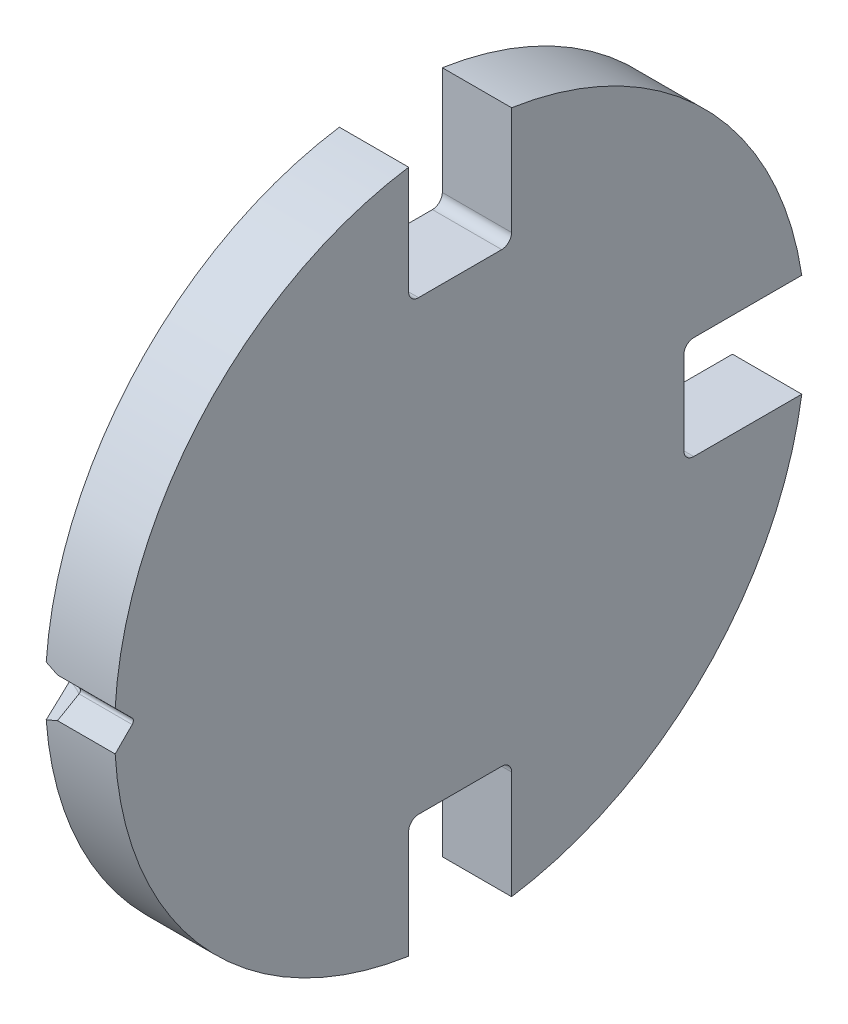
ISO-10303-21;
HEADER;
FILE_DESCRIPTION(('STEP AP214'),'2;1');
FILE_NAME('part.step','',(''),(''),'','','');
FILE_SCHEMA(('AUTOMOTIVE_DESIGN { 1 0 10303 214 1 1 1 1 }'));
ENDSEC;
DATA;
#1=APPLICATION_CONTEXT('core data for automotive mechanical design processes');
#2=APPLICATION_PROTOCOL_DEFINITION('international standard','automotive_design',2000,#1);
#3=PRODUCT_CONTEXT('',#1,'mechanical');
#4=PRODUCT('Part','Part','',(#3));
#5=PRODUCT_RELATED_PRODUCT_CATEGORY('part','',(#4));
#6=PRODUCT_DEFINITION_FORMATION('','',#4);
#7=PRODUCT_DEFINITION_CONTEXT('part definition',#1,'design');
#8=PRODUCT_DEFINITION('design','',#6,#7);
#9=PRODUCT_DEFINITION_SHAPE('','',#8);
#10=(LENGTH_UNIT() NAMED_UNIT(*) SI_UNIT(.MILLI.,.METRE.));
#11=(NAMED_UNIT(*) PLANE_ANGLE_UNIT() SI_UNIT($,.RADIAN.));
#12=(NAMED_UNIT(*) SI_UNIT($,.STERADIAN.) SOLID_ANGLE_UNIT());
#13=UNCERTAINTY_MEASURE_WITH_UNIT(LENGTH_MEASURE(1.E-05),#10,'distance_accuracy_value','');
#14=(GEOMETRIC_REPRESENTATION_CONTEXT(3) GLOBAL_UNCERTAINTY_ASSIGNED_CONTEXT((#13)) GLOBAL_UNIT_ASSIGNED_CONTEXT((#10,
#11,#12)) REPRESENTATION_CONTEXT('',''));
#15=CARTESIAN_POINT('',(0.,0.,0.));
#16=DIRECTION('',(0.,0.,1.));
#17=DIRECTION('',(1.,0.,0.));
#18=AXIS2_PLACEMENT_3D('',#15,#16,#17);
#19=CARTESIAN_POINT('',(156.05,0.,8.725));
#20=DIRECTION('',(1.,0.,0.));
#21=DIRECTION('',(0.,1.,0.));
#22=AXIS2_PLACEMENT_3D('',#19,#20,#21);
#23=PLANE('',#22);
#24=DIRECTION('',(0.,-0.707106781186548,0.707106781186547));
#25=VECTOR('',#24,1.);
#26=CARTESIAN_POINT('',(156.05,1.67408078537024,14.7472423561298));
#27=LINE('',#26,#25);
#28=CARTESIAN_POINT('',(156.05,-0.14142135623731,16.5627444977373));
#29=VERTEX_POINT('',#28);
#30=CARTESIAN_POINT('',(156.05,-1.00000000001903,17.421323141519));
#31=VERTEX_POINT('',#30);
#32=EDGE_CURVE('E404',#29,#31,#27,.T.);
#33=ORIENTED_EDGE('',*,*,#32,.T.);
#34=CARTESIAN_POINT('',(156.05,0.,0.));
#35=DIRECTION('',(1.,0.,0.));
#36=DIRECTION('',(0.,0.,1.));
#37=AXIS2_PLACEMENT_3D('',#34,#35,#36);
#38=CIRCLE('',#37,17.45);
#39=CARTESIAN_POINT('',(156.05,-17.2552166025234,2.6));
#40=VERTEX_POINT('',#39);
#41=EDGE_CURVE('E410',#31,#40,#38,.T.);
#42=ORIENTED_EDGE('',*,*,#41,.T.);
#43=DIRECTION('',(0.,1.,0.));
#44=VECTOR('',#43,1.);
#45=CARTESIAN_POINT('',(156.05,-8.4,2.6));
#46=LINE('',#45,#44);
#47=CARTESIAN_POINT('',(156.05,-11.8,2.6));
#48=VERTEX_POINT('',#47);
#49=EDGE_CURVE('E541',#40,#48,#46,.T.);
#50=ORIENTED_EDGE('',*,*,#49,.T.);
#51=CARTESIAN_POINT('',(156.05,-11.8000000001,2.0999999999));
#52=DIRECTION('',(-1.,0.,0.));
#53=DIRECTION('',(0.,1.,2.00716776532771E-10));
#54=AXIS2_PLACEMENT_3D('',#51,#52,#53);
#55=CIRCLE('',#54,0.5);
#56=CARTESIAN_POINT('',(156.05,-11.3000000001,2.10000000000036));
#57=VERTEX_POINT('',#56);
#58=EDGE_CURVE('E544',#48,#57,#55,.T.);
#59=ORIENTED_EDGE('',*,*,#58,.T.);
#60=DIRECTION('',(0.,0.,-1.));
#61=VECTOR('',#60,1.);
#62=CARTESIAN_POINT('',(156.05,-11.3,3.8375));
#63=LINE('',#62,#61);
#64=CARTESIAN_POINT('',(156.05,-11.3,-2.1));
#65=VERTEX_POINT('',#64);
#66=EDGE_CURVE('E615',#57,#65,#63,.T.);
#67=ORIENTED_EDGE('',*,*,#66,.T.);
#68=CARTESIAN_POINT('',(156.05,-11.8000000001,-2.0999999999));
#69=DIRECTION('',(-1.,0.,0.));
#70=DIRECTION('',(0.,2.00714111997513E-10,-1.));
#71=AXIS2_PLACEMENT_3D('',#68,#69,#70);
#72=CIRCLE('',#71,0.5);
#73=CARTESIAN_POINT('',(156.05,-11.7999999999996,-2.5999999999));
#74=VERTEX_POINT('',#73);
#75=EDGE_CURVE('E519',#65,#74,#72,.T.);
#76=ORIENTED_EDGE('',*,*,#75,.T.);
#77=DIRECTION('',(0.,-1.,0.));
#78=VECTOR('',#77,1.);
#79=CARTESIAN_POINT('',(156.05,-8.39999999999991,-2.6));
#80=LINE('',#79,#78);
#81=CARTESIAN_POINT('',(156.05,-17.2552166025234,-2.6));
#82=VERTEX_POINT('',#81);
#83=EDGE_CURVE('E566',#74,#82,#80,.T.);
#84=ORIENTED_EDGE('',*,*,#83,.T.);
#85=CARTESIAN_POINT('',(156.05,0.,0.));
#86=DIRECTION('',(1.,0.,0.));
#87=DIRECTION('',(0.,0.,1.));
#88=AXIS2_PLACEMENT_3D('',#85,#86,#87);
#89=CIRCLE('',#88,17.45);
#90=CARTESIAN_POINT('',(156.05,-2.6,-17.2552166025234));
#91=VERTEX_POINT('',#90);
#92=EDGE_CURVE('E552',#82,#91,#89,.T.);
#93=ORIENTED_EDGE('',*,*,#92,.T.);
#94=DIRECTION('',(0.,0.,1.));
#95=VECTOR('',#94,1.);
#96=CARTESIAN_POINT('',(156.05,-2.6,-4.0375));
#97=LINE('',#96,#95);
#98=CARTESIAN_POINT('',(156.05,-2.6,-11.8));
#99=VERTEX_POINT('',#98);
#100=EDGE_CURVE('E602',#91,#99,#97,.T.);
#101=ORIENTED_EDGE('',*,*,#100,.T.);
#102=CARTESIAN_POINT('',(156.05,-2.0999999999,-11.8000000001));
#103=DIRECTION('',(-1.,0.,0.));
#104=DIRECTION('',(0.,-2.00716776532771E-10,1.));
#105=AXIS2_PLACEMENT_3D('',#102,#103,#104);
#106=CIRCLE('',#105,0.5);
#107=CARTESIAN_POINT('',(156.05,-2.10000000000036,-11.3000000001));
#108=VERTEX_POINT('',#107);
#109=EDGE_CURVE('E597',#99,#108,#106,.T.);
#110=ORIENTED_EDGE('',*,*,#109,.T.);
#111=DIRECTION('',(0.,1.,0.));
#112=VECTOR('',#111,1.);
#113=CARTESIAN_POINT('',(156.05,0.525,-11.3));
#114=LINE('',#113,#112);
#115=CARTESIAN_POINT('',(156.05,2.1,-11.3));
#116=VERTEX_POINT('',#115);
#117=EDGE_CURVE('E556',#108,#116,#114,.T.);
#118=ORIENTED_EDGE('',*,*,#117,.T.);
#119=CARTESIAN_POINT('',(156.05,2.0999999999,-11.8000000001));
#120=DIRECTION('',(-1.,0.,0.));
#121=DIRECTION('',(0.,1.,2.00714111997513E-10));
#122=AXIS2_PLACEMENT_3D('',#119,#120,#121);
#123=CIRCLE('',#122,0.5);
#124=CARTESIAN_POINT('',(156.05,2.5999999999,-11.7999999999996));
#125=VERTEX_POINT('',#124);
#126=EDGE_CURVE('E952',#116,#125,#123,.T.);
#127=ORIENTED_EDGE('',*,*,#126,.T.);
#128=DIRECTION('',(0.,0.,-1.));
#129=VECTOR('',#128,1.);
#130=CARTESIAN_POINT('',(156.05,2.6,-4.03749999999991));
#131=LINE('',#130,#129);
#132=CARTESIAN_POINT('',(156.05,2.6,-17.2552166025234));
#133=VERTEX_POINT('',#132);
#134=EDGE_CURVE('E953',#125,#133,#131,.T.);
#135=ORIENTED_EDGE('',*,*,#134,.T.);
#136=CARTESIAN_POINT('',(156.05,0.,0.));
#137=DIRECTION('',(1.,0.,0.));
#138=DIRECTION('',(0.,0.,1.));
#139=AXIS2_PLACEMENT_3D('',#136,#137,#138);
#140=CIRCLE('',#139,17.45);
#141=CARTESIAN_POINT('',(156.05,17.2552166025234,-2.6));
#142=VERTEX_POINT('',#141);
#143=EDGE_CURVE('E606',#133,#142,#140,.T.);
#144=ORIENTED_EDGE('',*,*,#143,.T.);
#145=DIRECTION('',(0.,-1.,0.));
#146=VECTOR('',#145,1.);
#147=CARTESIAN_POINT('',(156.05,8.4,-2.6));
#148=LINE('',#147,#146);
#149=CARTESIAN_POINT('',(156.05,11.8,-2.6));
#150=VERTEX_POINT('',#149);
#151=EDGE_CURVE('E596',#142,#150,#148,.T.);
#152=ORIENTED_EDGE('',*,*,#151,.T.);
#153=CARTESIAN_POINT('',(156.05,11.8000000001,-2.0999999999));
#154=DIRECTION('',(-1.,0.,0.));
#155=DIRECTION('',(0.,-1.,-2.00716776532771E-10));
#156=AXIS2_PLACEMENT_3D('',#153,#154,#155);
#157=CIRCLE('',#156,0.5);
#158=CARTESIAN_POINT('',(156.05,11.3000000001,-2.10000000000036));
#159=VERTEX_POINT('',#158);
#160=EDGE_CURVE('E965',#150,#159,#157,.T.);
#161=ORIENTED_EDGE('',*,*,#160,.T.);
#162=DIRECTION('',(0.,0.,1.));
#163=VECTOR('',#162,1.);
#164=CARTESIAN_POINT('',(156.05,11.3,4.8875));
#165=LINE('',#164,#163);
#166=CARTESIAN_POINT('',(156.05,11.3,2.1));
#167=VERTEX_POINT('',#166);
#168=EDGE_CURVE('E11',#159,#167,#165,.T.);
#169=ORIENTED_EDGE('',*,*,#168,.T.);
#170=CARTESIAN_POINT('',(156.05,11.8000000001,2.0999999999));
#171=DIRECTION('',(-1.,0.,0.));
#172=DIRECTION('',(0.,-2.00714111997513E-10,1.));
#173=AXIS2_PLACEMENT_3D('',#170,#171,#172);
#174=CIRCLE('',#173,0.5);
#175=CARTESIAN_POINT('',(156.05,11.7999999999996,2.5999999999));
#176=VERTEX_POINT('',#175);
#177=EDGE_CURVE('E943',#167,#176,#174,.T.);
#178=ORIENTED_EDGE('',*,*,#177,.T.);
#179=DIRECTION('',(0.,1.,0.));
#180=VECTOR('',#179,1.);
#181=CARTESIAN_POINT('',(156.05,8.39999999999991,2.6));
#182=LINE('',#181,#180);
#183=CARTESIAN_POINT('',(156.05,17.2552166025234,2.6));
#184=VERTEX_POINT('',#183);
#185=EDGE_CURVE('E576',#176,#184,#182,.T.);
#186=ORIENTED_EDGE('',*,*,#185,.T.);
#187=CARTESIAN_POINT('',(156.05,0.,0.));
#188=DIRECTION('',(1.,0.,0.));
#189=DIRECTION('',(0.,0.,1.));
#190=AXIS2_PLACEMENT_3D('',#187,#188,#189);
#191=CIRCLE('',#190,17.45);
#192=CARTESIAN_POINT('',(156.05,1.00000000001902,17.421323141519));
#193=VERTEX_POINT('',#192);
#194=EDGE_CURVE('E397',#184,#193,#191,.T.);
#195=ORIENTED_EDGE('',*,*,#194,.T.);
#196=DIRECTION('',(0.,-0.707106781186547,-0.707106781186548));
#197=VECTOR('',#196,1.);
#198=CARTESIAN_POINT('',(156.05,-1.67408078537024,14.7472423561298));
#199=LINE('',#198,#197);
#200=CARTESIAN_POINT('',(156.05,0.141421356166717,16.5627444978081));
#201=VERTEX_POINT('',#200);
#202=EDGE_CURVE('E452',#193,#201,#199,.T.);
#203=ORIENTED_EDGE('',*,*,#202,.T.);
#204=CARTESIAN_POINT('',(156.05,0.,16.704165854116));
#205=DIRECTION('',(-1.,0.,0.));
#206=DIRECTION('',(0.,-0.707106780833585,-0.70710678153951));
#207=AXIS2_PLACEMENT_3D('',#204,#205,#206);
#208=CIRCLE('',#207,0.2);
#209=EDGE_CURVE('E418',#201,#29,#208,.T.);
#210=ORIENTED_EDGE('',*,*,#209,.T.);
#211=EDGE_LOOP('',(#33,#42,#50,#59,#67,#76,#84,#93,#101,#110,#118,#127,#135,#144,#152,#161,#169,
#178,#186,#195,#203,#210));
#212=FACE_BOUND('',#211,.T.);
#213=ADVANCED_FACE('F17',(#212),#23,.T.);
#214=CARTESIAN_POINT('',(152.55,11.3,1.05));
#215=DIRECTION('',(0.,-1.,0.));
#216=DIRECTION('',(0.,0.,-1.));
#217=AXIS2_PLACEMENT_3D('',#214,#215,#216);
#218=PLANE('',#217);
#219=ORIENTED_EDGE('',*,*,#168,.F.);
#220=DIRECTION('',(1.,0.,0.));
#221=VECTOR('',#220,1.);
#222=CARTESIAN_POINT('',(152.55,11.3000000001,-2.10000000000036));
#223=LINE('',#222,#221);
#224=CARTESIAN_POINT('',(152.55,11.3000000001,-2.10000000000036));
#225=VERTEX_POINT('',#224);
#226=EDGE_CURVE('E28',#225,#159,#223,.T.);
#227=ORIENTED_EDGE('',*,*,#226,.F.);
#228=DIRECTION('',(0.,0.,-1.));
#229=VECTOR('',#228,1.);
#230=CARTESIAN_POINT('',(152.55,11.3,4.8875));
#231=LINE('',#230,#229);
#232=CARTESIAN_POINT('',(152.55,11.3,2.1));
#233=VERTEX_POINT('',#232);
#234=EDGE_CURVE('E550',#233,#225,#231,.T.);
#235=ORIENTED_EDGE('',*,*,#234,.F.);
#236=DIRECTION('',(1.,0.,0.));
#237=VECTOR('',#236,1.);
#238=CARTESIAN_POINT('',(152.55,11.3,2.1));
#239=LINE('',#238,#237);
#240=EDGE_CURVE('E577',#233,#167,#239,.T.);
#241=ORIENTED_EDGE('',*,*,#240,.T.);
#242=EDGE_LOOP('',(#219,#227,#235,#241));
#243=FACE_BOUND('',#242,.T.);
#244=ADVANCED_FACE('F501',(#243),#218,.F.);
#245=CARTESIAN_POINT('',(152.55,11.8000000001,-2.0999999999));
#246=DIRECTION('',(1.,0.,0.));
#247=DIRECTION('',(0.,-1.,-2.00716776532771E-10));
#248=AXIS2_PLACEMENT_3D('',#245,#246,#247);
#249=CYLINDRICAL_SURFACE('',#248,0.5);
#250=ORIENTED_EDGE('',*,*,#160,.F.);
#251=DIRECTION('',(1.,0.,0.));
#252=VECTOR('',#251,1.);
#253=CARTESIAN_POINT('',(152.55,11.8,-2.6));
#254=LINE('',#253,#252);
#255=CARTESIAN_POINT('',(152.55,11.8,-2.6));
#256=VERTEX_POINT('',#255);
#257=EDGE_CURVE('E592',#256,#150,#254,.T.);
#258=ORIENTED_EDGE('',*,*,#257,.F.);
#259=CARTESIAN_POINT('',(152.55,11.8000000001,-2.0999999999));
#260=DIRECTION('',(1.,0.,0.));
#261=DIRECTION('',(0.,-1.,-2.00716776532771E-10));
#262=AXIS2_PLACEMENT_3D('',#259,#260,#261);
#263=CIRCLE('',#262,0.5);
#264=EDGE_CURVE('E954',#225,#256,#263,.T.);
#265=ORIENTED_EDGE('',*,*,#264,.F.);
#266=ORIENTED_EDGE('',*,*,#226,.T.);
#267=EDGE_LOOP('',(#250,#258,#265,#266));
#268=FACE_BOUND('',#267,.T.);
#269=ADVANCED_FACE('F505',(#268),#249,.F.);
#270=CARTESIAN_POINT('',(152.55,16.8,-2.6));
#271=DIRECTION('',(0.,0.,-1.));
#272=DIRECTION('',(0.,-1.,0.));
#273=AXIS2_PLACEMENT_3D('',#270,#271,#272);
#274=PLANE('',#273);
#275=DIRECTION('',(1.,0.,0.));
#276=VECTOR('',#275,1.);
#277=CARTESIAN_POINT('',(154.3,17.2552166025234,-2.6));
#278=LINE('',#277,#276);
#279=CARTESIAN_POINT('',(152.55,17.2552166025234,-2.6));
#280=VERTEX_POINT('',#279);
#281=EDGE_CURVE('E555',#280,#142,#278,.T.);
#282=ORIENTED_EDGE('',*,*,#281,.F.);
#283=DIRECTION('',(0.,1.,0.));
#284=VECTOR('',#283,1.);
#285=CARTESIAN_POINT('',(152.55,8.4,-2.6));
#286=LINE('',#285,#284);
#287=EDGE_CURVE('E958',#256,#280,#286,.T.);
#288=ORIENTED_EDGE('',*,*,#287,.F.);
#289=ORIENTED_EDGE('',*,*,#257,.T.);
#290=ORIENTED_EDGE('',*,*,#151,.F.);
#291=EDGE_LOOP('',(#282,#288,#289,#290));
#292=FACE_BOUND('',#291,.T.);
#293=ADVANCED_FACE('F19',(#292),#274,.F.);
#294=CARTESIAN_POINT('',(152.55,16.8,2.6));
#295=DIRECTION('',(0.,0.,1.));
#296=DIRECTION('',(1.,0.,0.));
#297=AXIS2_PLACEMENT_3D('',#294,#295,#296);
#298=PLANE('',#297);
#299=DIRECTION('',(-1.,0.,0.));
#300=VECTOR('',#299,1.);
#301=CARTESIAN_POINT('',(154.3,17.2552166025234,2.6));
#302=LINE('',#301,#300);
#303=CARTESIAN_POINT('',(152.55,17.2552166025234,2.6));
#304=VERTEX_POINT('',#303);
#305=EDGE_CURVE('E530',#184,#304,#302,.T.);
#306=ORIENTED_EDGE('',*,*,#305,.F.);
#307=ORIENTED_EDGE('',*,*,#185,.F.);
#308=DIRECTION('',(1.,0.,0.));
#309=VECTOR('',#308,1.);
#310=CARTESIAN_POINT('',(152.55,11.7999999999996,2.5999999999));
#311=LINE('',#310,#309);
#312=CARTESIAN_POINT('',(152.55,11.7999999999996,2.5999999999));
#313=VERTEX_POINT('',#312);
#314=EDGE_CURVE('E573',#313,#176,#311,.T.);
#315=ORIENTED_EDGE('',*,*,#314,.F.);
#316=DIRECTION('',(0.,-1.,0.));
#317=VECTOR('',#316,1.);
#318=CARTESIAN_POINT('',(152.55,8.39999999999991,2.6));
#319=LINE('',#318,#317);
#320=EDGE_CURVE('E551',#304,#313,#319,.T.);
#321=ORIENTED_EDGE('',*,*,#320,.F.);
#322=EDGE_LOOP('',(#306,#307,#315,#321));
#323=FACE_BOUND('',#322,.T.);
#324=ADVANCED_FACE('F498',(#323),#298,.F.);
#325=CARTESIAN_POINT('',(152.55,11.8000000001,2.0999999999));
#326=DIRECTION('',(1.,0.,0.));
#327=DIRECTION('',(0.,-2.00714111997513E-10,1.));
#328=AXIS2_PLACEMENT_3D('',#325,#326,#327);
#329=CYLINDRICAL_SURFACE('',#328,0.5);
#330=ORIENTED_EDGE('',*,*,#177,.F.);
#331=ORIENTED_EDGE('',*,*,#240,.F.);
#332=CARTESIAN_POINT('',(152.55,11.8000000001,2.0999999999));
#333=DIRECTION('',(1.,0.,0.));
#334=DIRECTION('',(0.,-2.00714111997513E-10,1.));
#335=AXIS2_PLACEMENT_3D('',#332,#333,#334);
#336=CIRCLE('',#335,0.5);
#337=EDGE_CURVE('E546',#313,#233,#336,.T.);
#338=ORIENTED_EDGE('',*,*,#337,.F.);
#339=ORIENTED_EDGE('',*,*,#314,.T.);
#340=EDGE_LOOP('',(#330,#331,#338,#339));
#341=FACE_BOUND('',#340,.T.);
#342=ADVANCED_FACE('F334',(#341),#329,.F.);
#343=CARTESIAN_POINT('',(154.3,0.,0.));
#344=DIRECTION('',(1.,0.,0.));
#345=DIRECTION('',(0.,0.,1.));
#346=AXIS2_PLACEMENT_3D('',#343,#344,#345);
#347=CYLINDRICAL_SURFACE('',#346,17.45);
#348=DIRECTION('',(-1.,0.,0.));
#349=VECTOR('',#348,1.);
#350=CARTESIAN_POINT('',(154.3,2.6,-17.2552166025234));
#351=LINE('',#350,#349);
#352=CARTESIAN_POINT('',(152.55,2.6,-17.2552166025234));
#353=VERTEX_POINT('',#352);
#354=EDGE_CURVE('E978',#133,#353,#351,.T.);
#355=ORIENTED_EDGE('',*,*,#354,.T.);
#356=CARTESIAN_POINT('',(152.55,0.,0.));
#357=DIRECTION('',(1.,0.,0.));
#358=DIRECTION('',(0.,0.,1.));
#359=AXIS2_PLACEMENT_3D('',#356,#357,#358);
#360=CIRCLE('',#359,17.45);
#361=EDGE_CURVE('E562',#353,#280,#360,.T.);
#362=ORIENTED_EDGE('',*,*,#361,.T.);
#363=ORIENTED_EDGE('',*,*,#281,.T.);
#364=ORIENTED_EDGE('',*,*,#143,.F.);
#365=EDGE_LOOP('',(#355,#362,#363,#364));
#366=FACE_BOUND('',#365,.T.);
#367=ADVANCED_FACE('F488',(#366),#347,.T.);
#368=CARTESIAN_POINT('',(154.3,0.,0.));
#369=DIRECTION('',(1.,0.,0.));
#370=DIRECTION('',(0.,0.,1.));
#371=AXIS2_PLACEMENT_3D('',#368,#369,#370);
#372=CYLINDRICAL_SURFACE('',#371,17.45);
#373=DIRECTION('',(-1.,0.,0.));
#374=VECTOR('',#373,1.);
#375=CARTESIAN_POINT('',(154.3,-17.2552166025234,-2.6));
#376=LINE('',#375,#374);
#377=CARTESIAN_POINT('',(152.55,-17.2552166025234,-2.6));
#378=VERTEX_POINT('',#377);
#379=EDGE_CURVE('E563',#82,#378,#376,.T.);
#380=ORIENTED_EDGE('',*,*,#379,.T.);
#381=CARTESIAN_POINT('',(152.55,0.,0.));
#382=DIRECTION('',(1.,0.,0.));
#383=DIRECTION('',(0.,0.,1.));
#384=AXIS2_PLACEMENT_3D('',#381,#382,#383);
#385=CIRCLE('',#384,17.45);
#386=CARTESIAN_POINT('',(152.55,-2.6,-17.2552166025234));
#387=VERTEX_POINT('',#386);
#388=EDGE_CURVE('E587',#378,#387,#385,.T.);
#389=ORIENTED_EDGE('',*,*,#388,.T.);
#390=DIRECTION('',(1.,0.,0.));
#391=VECTOR('',#390,1.);
#392=CARTESIAN_POINT('',(154.3,-2.6,-17.2552166025234));
#393=LINE('',#392,#391);
#394=EDGE_CURVE('E611',#387,#91,#393,.T.);
#395=ORIENTED_EDGE('',*,*,#394,.T.);
#396=ORIENTED_EDGE('',*,*,#92,.F.);
#397=EDGE_LOOP('',(#380,#389,#395,#396));
#398=FACE_BOUND('',#397,.T.);
#399=ADVANCED_FACE('F303',(#398),#372,.T.);
#400=CARTESIAN_POINT('',(152.55,1.05,-11.3));
#401=DIRECTION('',(0.,0.,1.));
#402=DIRECTION('',(1.,0.,0.));
#403=AXIS2_PLACEMENT_3D('',#400,#401,#402);
#404=PLANE('',#403);
#405=ORIENTED_EDGE('',*,*,#117,.F.);
#406=DIRECTION('',(1.,0.,0.));
#407=VECTOR('',#406,1.);
#408=CARTESIAN_POINT('',(152.55,-2.10000000000036,-11.3000000001));
#409=LINE('',#408,#407);
#410=CARTESIAN_POINT('',(152.55,-2.10000000000036,-11.3000000001));
#411=VERTEX_POINT('',#410);
#412=EDGE_CURVE('E601',#411,#108,#409,.T.);
#413=ORIENTED_EDGE('',*,*,#412,.F.);
#414=DIRECTION('',(0.,-1.,0.));
#415=VECTOR('',#414,1.);
#416=CARTESIAN_POINT('',(152.55,0.525,-11.3));
#417=LINE('',#416,#415);
#418=CARTESIAN_POINT('',(152.55,2.1,-11.3));
#419=VERTEX_POINT('',#418);
#420=EDGE_CURVE('E540',#419,#411,#417,.T.);
#421=ORIENTED_EDGE('',*,*,#420,.F.);
#422=DIRECTION('',(1.,0.,0.));
#423=VECTOR('',#422,1.);
#424=CARTESIAN_POINT('',(152.55,2.1,-11.3));
#425=LINE('',#424,#423);
#426=EDGE_CURVE('E172',#419,#116,#425,.T.);
#427=ORIENTED_EDGE('',*,*,#426,.T.);
#428=EDGE_LOOP('',(#405,#413,#421,#427));
#429=FACE_BOUND('',#428,.T.);
#430=ADVANCED_FACE('F496',(#429),#404,.F.);
#431=CARTESIAN_POINT('',(152.55,-2.0999999999,-11.8000000001));
#432=DIRECTION('',(1.,0.,0.));
#433=DIRECTION('',(0.,-2.00716776532771E-10,1.));
#434=AXIS2_PLACEMENT_3D('',#431,#432,#433);
#435=CYLINDRICAL_SURFACE('',#434,0.5);
#436=ORIENTED_EDGE('',*,*,#109,.F.);
#437=DIRECTION('',(1.,0.,0.));
#438=VECTOR('',#437,1.);
#439=CARTESIAN_POINT('',(152.55,-2.6,-11.8));
#440=LINE('',#439,#438);
#441=CARTESIAN_POINT('',(152.55,-2.6,-11.8));
#442=VERTEX_POINT('',#441);
#443=EDGE_CURVE('E607',#442,#99,#440,.T.);
#444=ORIENTED_EDGE('',*,*,#443,.F.);
#445=CARTESIAN_POINT('',(152.55,-2.0999999999,-11.8000000001));
#446=DIRECTION('',(1.,0.,0.));
#447=DIRECTION('',(0.,-2.00716776532771E-10,1.));
#448=AXIS2_PLACEMENT_3D('',#445,#446,#447);
#449=CIRCLE('',#448,0.5);
#450=EDGE_CURVE('E1178',#411,#442,#449,.T.);
#451=ORIENTED_EDGE('',*,*,#450,.F.);
#452=ORIENTED_EDGE('',*,*,#412,.T.);
#453=EDGE_LOOP('',(#436,#444,#451,#452));
#454=FACE_BOUND('',#453,.T.);
#455=ADVANCED_FACE('F278',(#454),#435,.F.);
#456=CARTESIAN_POINT('',(152.55,-2.6,-16.8));
#457=DIRECTION('',(0.,-1.,0.));
#458=DIRECTION('',(0.,0.,-1.));
#459=AXIS2_PLACEMENT_3D('',#456,#457,#458);
#460=PLANE('',#459);
#461=ORIENTED_EDGE('',*,*,#394,.F.);
#462=DIRECTION('',(0.,0.,-1.));
#463=VECTOR('',#462,1.);
#464=CARTESIAN_POINT('',(152.55,-2.6,-4.0375));
#465=LINE('',#464,#463);
#466=EDGE_CURVE('E1017',#442,#387,#465,.T.);
#467=ORIENTED_EDGE('',*,*,#466,.F.);
#468=ORIENTED_EDGE('',*,*,#443,.T.);
#469=ORIENTED_EDGE('',*,*,#100,.F.);
#470=EDGE_LOOP('',(#461,#467,#468,#469));
#471=FACE_BOUND('',#470,.T.);
#472=ADVANCED_FACE('F751',(#471),#460,.F.);
#473=CARTESIAN_POINT('',(152.55,2.0999999999,-11.8000000001));
#474=DIRECTION('',(1.,0.,0.));
#475=DIRECTION('',(0.,1.,2.00714111997513E-10));
#476=AXIS2_PLACEMENT_3D('',#473,#474,#475);
#477=CYLINDRICAL_SURFACE('',#476,0.5);
#478=ORIENTED_EDGE('',*,*,#126,.F.);
#479=ORIENTED_EDGE('',*,*,#426,.F.);
#480=CARTESIAN_POINT('',(152.55,2.0999999999,-11.8000000001));
#481=DIRECTION('',(1.,0.,0.));
#482=DIRECTION('',(0.,1.,2.00714111997513E-10));
#483=AXIS2_PLACEMENT_3D('',#480,#481,#482);
#484=CIRCLE('',#483,0.5);
#485=CARTESIAN_POINT('',(152.55,2.5999999999,-11.7999999999996));
#486=VERTEX_POINT('',#485);
#487=EDGE_CURVE('E561',#486,#419,#484,.T.);
#488=ORIENTED_EDGE('',*,*,#487,.F.);
#489=DIRECTION('',(1.,0.,0.));
#490=VECTOR('',#489,1.);
#491=CARTESIAN_POINT('',(152.55,2.5999999999,-11.7999999999996));
#492=LINE('',#491,#490);
#493=EDGE_CURVE('E161',#486,#125,#492,.T.);
#494=ORIENTED_EDGE('',*,*,#493,.T.);
#495=EDGE_LOOP('',(#478,#479,#488,#494));
#496=FACE_BOUND('',#495,.T.);
#497=ADVANCED_FACE('F746',(#496),#477,.F.);
#498=CARTESIAN_POINT('',(152.55,2.6,-16.8));
#499=DIRECTION('',(0.,1.,0.));
#500=DIRECTION('',(1.,0.,0.));
#501=AXIS2_PLACEMENT_3D('',#498,#499,#500);
#502=PLANE('',#501);
#503=ORIENTED_EDGE('',*,*,#354,.F.);
#504=ORIENTED_EDGE('',*,*,#134,.F.);
#505=ORIENTED_EDGE('',*,*,#493,.F.);
#506=DIRECTION('',(0.,0.,1.));
#507=VECTOR('',#506,1.);
#508=CARTESIAN_POINT('',(152.55,2.6,-4.03749999999991));
#509=LINE('',#508,#507);
#510=EDGE_CURVE('E557',#353,#486,#509,.T.);
#511=ORIENTED_EDGE('',*,*,#510,.F.);
#512=EDGE_LOOP('',(#503,#504,#505,#511));
#513=FACE_BOUND('',#512,.T.);
#514=ADVANCED_FACE('F264',(#513),#502,.F.);
#515=CARTESIAN_POINT('',(152.55,-11.3,-1.05));
#516=DIRECTION('',(0.,1.,0.));
#517=DIRECTION('',(1.,0.,0.));
#518=AXIS2_PLACEMENT_3D('',#515,#516,#517);
#519=PLANE('',#518);
#520=ORIENTED_EDGE('',*,*,#66,.F.);
#521=DIRECTION('',(1.,0.,0.));
#522=VECTOR('',#521,1.);
#523=CARTESIAN_POINT('',(152.55,-11.3000000001,2.10000000000036));
#524=LINE('',#523,#522);
#525=CARTESIAN_POINT('',(152.55,-11.3000000001,2.10000000000036));
#526=VERTEX_POINT('',#525);
#527=EDGE_CURVE('E591',#526,#57,#524,.T.);
#528=ORIENTED_EDGE('',*,*,#527,.F.);
#529=DIRECTION('',(0.,0.,1.));
#530=VECTOR('',#529,1.);
#531=CARTESIAN_POINT('',(152.55,-11.3,3.8375));
#532=LINE('',#531,#530);
#533=CARTESIAN_POINT('',(152.55,-11.3,-2.1));
#534=VERTEX_POINT('',#533);
#535=EDGE_CURVE('E570',#534,#526,#532,.T.);
#536=ORIENTED_EDGE('',*,*,#535,.F.);
#537=DIRECTION('',(1.,0.,0.));
#538=VECTOR('',#537,1.);
#539=CARTESIAN_POINT('',(152.55,-11.3,-2.1));
#540=LINE('',#539,#538);
#541=EDGE_CURVE('E522',#534,#65,#540,.T.);
#542=ORIENTED_EDGE('',*,*,#541,.T.);
#543=EDGE_LOOP('',(#520,#528,#536,#542));
#544=FACE_BOUND('',#543,.T.);
#545=ADVANCED_FACE('F270',(#544),#519,.F.);
#546=CARTESIAN_POINT('',(152.55,-11.8000000001,2.0999999999));
#547=DIRECTION('',(1.,0.,0.));
#548=DIRECTION('',(0.,1.,2.00716776532771E-10));
#549=AXIS2_PLACEMENT_3D('',#546,#547,#548);
#550=CYLINDRICAL_SURFACE('',#549,0.5);
#551=ORIENTED_EDGE('',*,*,#58,.F.);
#552=DIRECTION('',(1.,0.,0.));
#553=VECTOR('',#552,1.);
#554=CARTESIAN_POINT('',(152.55,-11.8,2.6));
#555=LINE('',#554,#553);
#556=CARTESIAN_POINT('',(152.55,-11.8,2.6));
#557=VERTEX_POINT('',#556);
#558=EDGE_CURVE('E545',#557,#48,#555,.T.);
#559=ORIENTED_EDGE('',*,*,#558,.F.);
#560=CARTESIAN_POINT('',(152.55,-11.8000000001,2.0999999999));
#561=DIRECTION('',(1.,0.,0.));
#562=DIRECTION('',(0.,1.,2.00716776532771E-10));
#563=AXIS2_PLACEMENT_3D('',#560,#561,#562);
#564=CIRCLE('',#563,0.5);
#565=EDGE_CURVE('E932',#526,#557,#564,.T.);
#566=ORIENTED_EDGE('',*,*,#565,.F.);
#567=ORIENTED_EDGE('',*,*,#527,.T.);
#568=EDGE_LOOP('',(#551,#559,#566,#567));
#569=FACE_BOUND('',#568,.T.);
#570=ADVANCED_FACE('F266',(#569),#550,.F.);
#571=CARTESIAN_POINT('',(152.55,-16.8,2.6));
#572=DIRECTION('',(0.,0.,1.));
#573=DIRECTION('',(1.,0.,0.));
#574=AXIS2_PLACEMENT_3D('',#571,#572,#573);
#575=PLANE('',#574);
#576=DIRECTION('',(1.,0.,0.));
#577=VECTOR('',#576,1.);
#578=CARTESIAN_POINT('',(154.3,-17.2552166025234,2.6));
#579=LINE('',#578,#577);
#580=CARTESIAN_POINT('',(152.55,-17.2552166025234,2.6));
#581=VERTEX_POINT('',#580);
#582=EDGE_CURVE('E413',#581,#40,#579,.T.);
#583=ORIENTED_EDGE('',*,*,#582,.F.);
#584=DIRECTION('',(0.,-1.,0.));
#585=VECTOR('',#584,1.);
#586=CARTESIAN_POINT('',(152.55,-8.4,2.6));
#587=LINE('',#586,#585);
#588=EDGE_CURVE('E936',#557,#581,#587,.T.);
#589=ORIENTED_EDGE('',*,*,#588,.F.);
#590=ORIENTED_EDGE('',*,*,#558,.T.);
#591=ORIENTED_EDGE('',*,*,#49,.F.);
#592=EDGE_LOOP('',(#583,#589,#590,#591));
#593=FACE_BOUND('',#592,.T.);
#594=ADVANCED_FACE('F269',(#593),#575,.F.);
#595=CARTESIAN_POINT('',(152.55,-16.8,-2.6));
#596=DIRECTION('',(0.,0.,-1.));
#597=DIRECTION('',(0.,-1.,0.));
#598=AXIS2_PLACEMENT_3D('',#595,#596,#597);
#599=PLANE('',#598);
#600=ORIENTED_EDGE('',*,*,#379,.F.);
#601=ORIENTED_EDGE('',*,*,#83,.F.);
#602=DIRECTION('',(1.,0.,0.));
#603=VECTOR('',#602,1.);
#604=CARTESIAN_POINT('',(152.55,-11.7999999999996,-2.5999999999));
#605=LINE('',#604,#603);
#606=CARTESIAN_POINT('',(152.55,-11.7999999999996,-2.5999999999));
#607=VERTEX_POINT('',#606);
#608=EDGE_CURVE('E524',#607,#74,#605,.T.);
#609=ORIENTED_EDGE('',*,*,#608,.F.);
#610=DIRECTION('',(0.,1.,0.));
#611=VECTOR('',#610,1.);
#612=CARTESIAN_POINT('',(152.55,-8.39999999999991,-2.6));
#613=LINE('',#612,#611);
#614=EDGE_CURVE('E571',#378,#607,#613,.T.);
#615=ORIENTED_EDGE('',*,*,#614,.F.);
#616=EDGE_LOOP('',(#600,#601,#609,#615));
#617=FACE_BOUND('',#616,.T.);
#618=ADVANCED_FACE('F482',(#617),#599,.F.);
#619=CARTESIAN_POINT('',(152.55,-11.8000000001,-2.0999999999));
#620=DIRECTION('',(1.,0.,0.));
#621=DIRECTION('',(0.,2.00714111997513E-10,-1.));
#622=AXIS2_PLACEMENT_3D('',#619,#620,#621);
#623=CYLINDRICAL_SURFACE('',#622,0.5);
#624=ORIENTED_EDGE('',*,*,#75,.F.);
#625=ORIENTED_EDGE('',*,*,#541,.F.);
#626=CARTESIAN_POINT('',(152.55,-11.8000000001,-2.0999999999));
#627=DIRECTION('',(1.,0.,0.));
#628=DIRECTION('',(0.,2.00714111997513E-10,-1.));
#629=AXIS2_PLACEMENT_3D('',#626,#627,#628);
#630=CIRCLE('',#629,0.5);
#631=EDGE_CURVE('E567',#607,#534,#630,.T.);
#632=ORIENTED_EDGE('',*,*,#631,.F.);
#633=ORIENTED_EDGE('',*,*,#608,.T.);
#634=EDGE_LOOP('',(#624,#625,#632,#633));
#635=FACE_BOUND('',#634,.T.);
#636=ADVANCED_FACE('F479',(#635),#623,.F.);
#637=CARTESIAN_POINT('',(154.3,0.,0.));
#638=DIRECTION('',(1.,0.,0.));
#639=DIRECTION('',(0.,0.,1.));
#640=AXIS2_PLACEMENT_3D('',#637,#638,#639);
#641=CYLINDRICAL_SURFACE('',#640,17.45);
#642=CARTESIAN_POINT('',(152.549984041793,1.2620055596336,17.4043052710372));
#643=CARTESIAN_POINT('',(152.574004759406,1.2524614478661,17.404997329583));
#644=CARTESIAN_POINT('',(152.597972918042,1.24278542862647,17.4056910525221));
#645=CARTESIAN_POINT('',(152.646040961841,1.22308106644213,17.4070868090204));
#646=CARTESIAN_POINT('',(152.670139806576,1.21305018599939,17.4077888569355));
#647=CARTESIAN_POINT('',(152.71846921287,1.19263604542212,17.4091994356543));
#648=CARTESIAN_POINT('',(152.742698715732,1.18225027951406,17.4099079618143));
#649=CARTESIAN_POINT('',(152.791289463904,1.16112622036414,17.4113296180113));
#650=CARTESIAN_POINT('',(152.815649634129,1.15038545307127,17.4120427240594));
#651=CARTESIAN_POINT('',(152.864501730794,1.12855127210781,17.4134715925201));
#652=CARTESIAN_POINT('',(152.888992567124,1.11745541717128,17.4141873111116));
#653=CARTESIAN_POINT('',(152.938106012401,1.0949109311519,17.4156193945438));
#654=CARTESIAN_POINT('',(152.962727517676,1.0834598921328,17.4163356953333));
#655=CARTESIAN_POINT('',(153.012102309912,1.06020493764056,17.4177668639475));
#656=CARTESIAN_POINT('',(153.03685448095,1.04839864838865,17.4184816470562));
#657=CARTESIAN_POINT('',(153.086490632286,1.02443300442061,17.4199076520258));
#658=CARTESIAN_POINT('',(153.111373485928,1.01227130962805,17.4206187682973));
#659=CARTESIAN_POINT('',(153.136199245544,0.999993980489181,17.4213234870083));
#660=B_SPLINE_CURVE_WITH_KNOTS('',3,(#642,#643,#644,#645,#646,#647,#648,#649,#650,#651,#652,
#653,#654,#655,#656,#657,#658,#659),.UNSPECIFIED.,.F.,.F.,(4,2,2,2,2,2,2,2,4),(0.,
0.0775692822157128,0.155905458792852,0.235017337348199,0.314913468961092,0.395602155373342,
0.477091456100392,0.559389195440985,0.642502969374284),.UNSPECIFIED.);
#661=CARTESIAN_POINT('',(152.55,1.26204551356524,17.404302373887));
#662=VERTEX_POINT('',#661);
#663=CARTESIAN_POINT('',(153.136202233142,0.999999999984703,17.4213231414847));
#664=VERTEX_POINT('',#663);
#665=EDGE_CURVE('E200',#662,#664,#660,.T.);
#666=ORIENTED_EDGE('',*,*,#665,.T.);
#667=DIRECTION('',(1.,0.,0.));
#668=VECTOR('',#667,1.);
#669=CARTESIAN_POINT('',(154.3,0.999999999984704,17.4213231414847));
#670=LINE('',#669,#668);
#671=EDGE_CURVE('E446',#664,#193,#670,.T.);
#672=ORIENTED_EDGE('',*,*,#671,.T.);
#673=ORIENTED_EDGE('',*,*,#194,.F.);
#674=ORIENTED_EDGE('',*,*,#305,.T.);
#675=CARTESIAN_POINT('',(152.55,0.,0.));
#676=DIRECTION('',(1.,0.,0.));
#677=DIRECTION('',(0.,0.,1.));
#678=AXIS2_PLACEMENT_3D('',#675,#676,#677);
#679=CIRCLE('',#678,17.45);
#680=EDGE_CURVE('E416',#304,#662,#679,.T.);
#681=ORIENTED_EDGE('',*,*,#680,.T.);
#682=EDGE_LOOP('',(#666,#672,#673,#674,#681));
#683=FACE_BOUND('',#682,.T.);
#684=ADVANCED_FACE('F302',(#683),#641,.T.);
#685=CARTESIAN_POINT('',(152.55,0.,8.725));
#686=DIRECTION('',(-1.,0.,0.));
#687=DIRECTION('',(0.,0.,1.));
#688=AXIS2_PLACEMENT_3D('',#685,#686,#687);
#689=PLANE('',#688);
#690=CARTESIAN_POINT('',(152.55,0.141421356166719,16.1920119512789));
#691=CARTESIAN_POINT('',(152.55,1.28264588098791,17.406803213166));
#692=CARTESIAN_POINT('',(152.55,2.,18.2362134409588));
#693=(BOUNDED_CURVE() B_SPLINE_CURVE(2,(#690,#691,#692),.UNSPECIFIED.,.F.,
.F.) B_SPLINE_CURVE_WITH_KNOTS((3,3),(0.,2.76294009910771),
.UNSPECIFIED.) CURVE() GEOMETRIC_REPRESENTATION_ITEM() RATIONAL_B_SPLINE_CURVE((1.,
1.02221656732641,1.)) REPRESENTATION_ITEM(''));
#694=CARTESIAN_POINT('',(152.55,0.141421356166717,16.1920119513457));
#695=VERTEX_POINT('',#694);
#696=EDGE_CURVE('E192',#695,#662,#693,.T.);
#697=ORIENTED_EDGE('',*,*,#696,.T.);
#698=ORIENTED_EDGE('',*,*,#680,.F.);
#699=ORIENTED_EDGE('',*,*,#320,.T.);
#700=ORIENTED_EDGE('',*,*,#337,.T.);
#701=ORIENTED_EDGE('',*,*,#234,.T.);
#702=ORIENTED_EDGE('',*,*,#264,.T.);
#703=ORIENTED_EDGE('',*,*,#287,.T.);
#704=ORIENTED_EDGE('',*,*,#361,.F.);
#705=ORIENTED_EDGE('',*,*,#510,.T.);
#706=ORIENTED_EDGE('',*,*,#487,.T.);
#707=ORIENTED_EDGE('',*,*,#420,.T.);
#708=ORIENTED_EDGE('',*,*,#450,.T.);
#709=ORIENTED_EDGE('',*,*,#466,.T.);
#710=ORIENTED_EDGE('',*,*,#388,.F.);
#711=ORIENTED_EDGE('',*,*,#614,.T.);
#712=ORIENTED_EDGE('',*,*,#631,.T.);
#713=ORIENTED_EDGE('',*,*,#535,.T.);
#714=ORIENTED_EDGE('',*,*,#565,.T.);
#715=ORIENTED_EDGE('',*,*,#588,.T.);
#716=CARTESIAN_POINT('',(152.55,0.,0.));
#717=DIRECTION('',(1.,0.,0.));
#718=DIRECTION('',(0.,0.,1.));
#719=AXIS2_PLACEMENT_3D('',#716,#717,#718);
#720=CIRCLE('',#719,17.45);
#721=CARTESIAN_POINT('',(152.55,-1.26204551362406,17.4043023738828));
#722=VERTEX_POINT('',#721);
#723=EDGE_CURVE('E421',#722,#581,#720,.T.);
#724=ORIENTED_EDGE('',*,*,#723,.F.);
#725=CARTESIAN_POINT('',(152.55,-2.,18.2362134408863));
#726=CARTESIAN_POINT('',(152.55,-1.28264588099418,17.4068032131051));
#727=CARTESIAN_POINT('',(152.55,-0.141421356200002,16.1920119512476));
#728=(BOUNDED_CURVE() B_SPLINE_CURVE(2,(#725,#726,#727),.UNSPECIFIED.,.F.,
.F.) B_SPLINE_CURVE_WITH_KNOTS((3,3),(0.,2.76294009905483),
.UNSPECIFIED.) CURVE() GEOMETRIC_REPRESENTATION_ITEM() RATIONAL_B_SPLINE_CURVE((1.,
1.02221656732572,1.)) REPRESENTATION_ITEM(''));
#729=CARTESIAN_POINT('',(152.55,-0.1414213562,16.1920119512476));
#730=VERTEX_POINT('',#729);
#731=EDGE_CURVE('E441',#722,#730,#728,.T.);
#732=ORIENTED_EDGE('',*,*,#731,.T.);
#733=CARTESIAN_POINT('',(152.55,-0.141418561940073,16.1920145612869));
#734=CARTESIAN_POINT('',(152.55,-0.114582624857568,16.1632845022229));
#735=CARTESIAN_POINT('',(152.55,-0.07708901902708,16.1461336258315));
#736=CARTESIAN_POINT('',(152.55,-0.0411594086178533,16.1296981752189));
#737=CARTESIAN_POINT('',(152.55,0.,16.1296981752189));
#738=B_SPLINE_CURVE_WITH_KNOTS('',2,(#733,#734,#735,#736,#737),.UNSPECIFIED.,.F.,.F.,(3,2,3),
(0.,0.5,1.),.UNSPECIFIED.);
#739=CARTESIAN_POINT('',(152.55,0.,16.129698175219));
#740=VERTEX_POINT('',#739);
#741=EDGE_CURVE('E215',#730,#740,#738,.T.);
#742=ORIENTED_EDGE('',*,*,#741,.T.);
#743=CARTESIAN_POINT('',(152.55,0.,16.1296981752189));
#744=CARTESIAN_POINT('',(152.55,0.0395643504321924,16.1296981752189));
#745=CARTESIAN_POINT('',(152.55,0.0770890190494239,16.1461336258416));
#746=CARTESIAN_POINT('',(152.55,0.113430172526531,16.1620507080052));
#747=CARTESIAN_POINT('',(152.55,0.141418561973502,16.1920145613227));
#748=B_SPLINE_CURVE_WITH_KNOTS('',2,(#743,#744,#745,#746,#747),.UNSPECIFIED.,.F.,.F.,(3,2,3),
(0.,0.5,1.),.UNSPECIFIED.);
#749=EDGE_CURVE('E209',#740,#695,#748,.T.);
#750=ORIENTED_EDGE('',*,*,#749,.T.);
#751=EDGE_LOOP('',(#697,#698,#699,#700,#701,#702,#703,#704,#705,#706,#707,#708,#709,#710,#711,
#712,#713,#714,#715,#724,#732,#742,#750));
#752=FACE_BOUND('',#751,.T.);
#753=ADVANCED_FACE('F211',(#752),#689,.T.);
#754=CARTESIAN_POINT('',(154.3,0.,0.));
#755=DIRECTION('',(1.,0.,0.));
#756=DIRECTION('',(0.,0.,1.));
#757=AXIS2_PLACEMENT_3D('',#754,#755,#756);
#758=CYLINDRICAL_SURFACE('',#757,17.45);
#759=CARTESIAN_POINT('',(153.136199245664,-0.999993980489205,17.4213234870083));
#760=CARTESIAN_POINT('',(153.111373486042,-1.01227130963108,17.4206187682971));
#761=CARTESIAN_POINT('',(153.086490632396,-1.02443300442662,17.4199076520255));
#762=CARTESIAN_POINT('',(153.036854481049,-1.04839864840047,17.4184816470555));
#763=CARTESIAN_POINT('',(153.012102310006,-1.06020493765521,17.4177668639466));
#764=CARTESIAN_POINT('',(152.96272751776,-1.08345989215295,17.416335695332));
#765=CARTESIAN_POINT('',(152.938106012479,-1.0949109311747,17.4156193945424));
#766=CARTESIAN_POINT('',(152.888992567192,-1.11745541719928,17.4141873111098));
#767=CARTESIAN_POINT('',(152.864501730857,-1.12855127213834,17.4134715925181));
#768=CARTESIAN_POINT('',(152.815649634182,-1.1503854531067,17.4120427240571));
#769=CARTESIAN_POINT('',(152.791289463953,-1.16112622040193,17.4113296180088));
#770=CARTESIAN_POINT('',(152.74269871577,-1.18225027955642,17.4099079618114));
#771=CARTESIAN_POINT('',(152.718469212904,-1.1926360454667,17.4091994356512));
#772=CARTESIAN_POINT('',(152.6701398066,-1.21305018604826,17.4077888569321));
#773=CARTESIAN_POINT('',(152.64604096186,-1.22308106649306,17.4070868090168));
#774=CARTESIAN_POINT('',(152.597972918052,-1.24278542868137,17.4056910525182));
#775=CARTESIAN_POINT('',(152.574004759411,-1.25246144792292,17.4049973295789));
#776=CARTESIAN_POINT('',(152.549984041793,-1.26200555969229,17.404305271033));
#777=B_SPLINE_CURVE_WITH_KNOTS('',3,(#759,#760,#761,#762,#763,#764,#765,#766,#767,#768,#769,
#770,#771,#772,#773,#774,#775,#776),.UNSPECIFIED.,.F.,.F.,(4,2,2,2,2,2,2,2,4),(0.,
0.0831137739513877,0.16541151330967,0.246900814053994,0.327589500483134,0.407485632112561,
0.486597510684004,0.564933687276907,0.642502969508011),.UNSPECIFIED.);
#778=CARTESIAN_POINT('',(153.136202233262,-0.999999999984704,17.4213231414847));
#779=VERTEX_POINT('',#778);
#780=EDGE_CURVE('E234',#779,#722,#777,.T.);
#781=ORIENTED_EDGE('',*,*,#780,.T.);
#782=ORIENTED_EDGE('',*,*,#723,.T.);
#783=ORIENTED_EDGE('',*,*,#582,.T.);
#784=ORIENTED_EDGE('',*,*,#41,.F.);
#785=DIRECTION('',(-1.,0.,0.));
#786=VECTOR('',#785,1.);
#787=CARTESIAN_POINT('',(154.3,-0.999999999984704,17.4213231414847));
#788=LINE('',#787,#786);
#789=EDGE_CURVE('E411',#31,#779,#788,.T.);
#790=ORIENTED_EDGE('',*,*,#789,.T.);
#791=EDGE_LOOP('',(#781,#782,#783,#784,#790));
#792=FACE_BOUND('',#791,.T.);
#793=ADVANCED_FACE('F253',(#792),#758,.T.);
#794=CARTESIAN_POINT('',(154.3,-0.500000000009513,16.9213231415095));
#795=DIRECTION('',(0.,0.707106781186547,0.707106781186548));
#796=DIRECTION('',(1.,0.,0.));
#797=AXIS2_PLACEMENT_3D('',#794,#795,#796);
#798=PLANE('',#797);
#799=CARTESIAN_POINT('',(153.366148465508,-0.141421356237309,16.5627444977373));
#800=CARTESIAN_POINT('',(153.25117534938,-0.588930382884142,17.0102535243841));
#801=CARTESIAN_POINT('',(153.136202233253,-1.00000000001903,17.421323141519));
#802=(BOUNDED_CURVE() B_SPLINE_CURVE(2,(#799,#800,#801),.UNSPECIFIED.,.F.,
.F.) B_SPLINE_CURVE_WITH_KNOTS((3,3),(0.,1.23580453185874),
.UNSPECIFIED.) CURVE() GEOMETRIC_REPRESENTATION_ITEM() RATIONAL_B_SPLINE_CURVE((1.,1.,1.)) REPRESENTATION_ITEM(''));
#803=CARTESIAN_POINT('',(153.366148465774,-0.1414213562,16.5627444978414));
#804=VERTEX_POINT('',#803);
#805=EDGE_CURVE('E354',#804,#779,#802,.T.);
#806=ORIENTED_EDGE('',*,*,#805,.T.);
#807=ORIENTED_EDGE('',*,*,#789,.F.);
#808=ORIENTED_EDGE('',*,*,#32,.F.);
#809=DIRECTION('',(-1.,0.,0.));
#810=VECTOR('',#809,1.);
#811=CARTESIAN_POINT('',(154.3,-0.141421356308022,16.562744497808));
#812=LINE('',#811,#810);
#813=EDGE_CURVE('E429',#29,#804,#812,.T.);
#814=ORIENTED_EDGE('',*,*,#813,.T.);
#815=EDGE_LOOP('',(#806,#807,#808,#814));
#816=FACE_BOUND('',#815,.T.);
#817=ADVANCED_FACE('F263',(#816),#798,.T.);
#818=CARTESIAN_POINT('',(152.55,0.,16.704165854116));
#819=DIRECTION('',(1.,0.,0.));
#820=DIRECTION('',(0.,-0.707106780833585,-0.70710678153951));
#821=AXIS2_PLACEMENT_3D('',#818,#819,#820);
#822=CYLINDRICAL_SURFACE('',#821,0.2);
#823=CARTESIAN_POINT('',(153.366148465523,0.141421356166718,16.5627444978081));
#824=CARTESIAN_POINT('',(153.370858471885,0.123088632519489,16.5444117741792));
#825=CARTESIAN_POINT('',(153.374622568659,0.101263201836575,16.529715924218));
#826=CARTESIAN_POINT('',(153.37971476852,0.0536199732843828,16.5098179709683));
#827=CARTESIAN_POINT('',(153.381057833624,0.0284534605300379,16.5045596862531));
#828=CARTESIAN_POINT('',(153.38124726749,-0.0223543471318883,16.5038184365011));
#829=CARTESIAN_POINT('',(153.380117123079,-0.047415603710975,16.5082435212383));
#830=CARTESIAN_POINT('',(153.376547737214,-0.0841809902183378,16.5221940956362));
#831=CARTESIAN_POINT('',(153.374910793186,-0.0968021615469716,16.5285886846907));
#832=CARTESIAN_POINT('',(153.370983217678,-0.12049500726954,16.5439127897724));
#833=CARTESIAN_POINT('',(153.368701436698,-0.131484444957783,16.5528075866068));
#834=CARTESIAN_POINT('',(153.366148465518,-0.141421356183354,16.5627444978248));
#835=(BOUNDED_CURVE() B_SPLINE_CURVE(3,(#823,#824,#825,#826,#827,#828,#829,#830,#831,#832,#833,
#834),.UNSPECIFIED.,.F.,.F.) B_SPLINE_CURVE_WITH_KNOTS((4,2,2,2,2,4),(0.,0.0790522298688049,
0.155720416251173,0.231595920516296,0.27423561839963,0.317099821434691),
.UNSPECIFIED.) CURVE() GEOMETRIC_REPRESENTATION_ITEM() RATIONAL_B_SPLINE_CURVE((1.,1.,1.,1.,1.,
1.,1.,1.,1.,1.,1.,1.)) REPRESENTATION_ITEM(''));
#836=CARTESIAN_POINT('',(153.366148465523,0.141421356166717,16.5627444978082));
#837=VERTEX_POINT('',#836);
#838=CARTESIAN_POINT('',(153.381158481402,0.,16.504165854116));
#839=VERTEX_POINT('',#838);
#840=EDGE_CURVE('E227',#837,#839,#835,.T.);
#841=ORIENTED_EDGE('',*,*,#840,.T.);
#842=CARTESIAN_POINT('',(153.366148465523,0.141421356166718,16.5627444978081));
#843=CARTESIAN_POINT('',(153.370858471885,0.123088632519489,16.5444117741792));
#844=CARTESIAN_POINT('',(153.374622568659,0.101263201836575,16.529715924218));
#845=CARTESIAN_POINT('',(153.37971476852,0.0536199732843828,16.5098179709683));
#846=CARTESIAN_POINT('',(153.381057833624,0.0284534605300379,16.5045596862531));
#847=CARTESIAN_POINT('',(153.38124726749,-0.0223543471318883,16.5038184365011));
#848=CARTESIAN_POINT('',(153.380117123079,-0.047415603710975,16.5082435212383));
#849=CARTESIAN_POINT('',(153.376547737214,-0.0841809902183378,16.5221940956362));
#850=CARTESIAN_POINT('',(153.374910793186,-0.0968021615469716,16.5285886846907));
#851=CARTESIAN_POINT('',(153.370983217678,-0.12049500726954,16.5439127897724));
#852=CARTESIAN_POINT('',(153.368701436698,-0.131484444957783,16.5528075866068));
#853=CARTESIAN_POINT('',(153.366148465518,-0.141421356183354,16.5627444978248));
#854=(BOUNDED_CURVE() B_SPLINE_CURVE(3,(#842,#843,#844,#845,#846,#847,#848,#849,#850,#851,#852,
#853),.UNSPECIFIED.,.F.,.F.) B_SPLINE_CURVE_WITH_KNOTS((4,2,2,2,2,4),(0.,0.0790522298688049,
0.155720416251173,0.231595920516296,0.27423561839963,0.317099821434691),
.UNSPECIFIED.) CURVE() GEOMETRIC_REPRESENTATION_ITEM() RATIONAL_B_SPLINE_CURVE((1.,1.,1.,1.,1.,
1.,1.,1.,1.,1.,1.,1.)) REPRESENTATION_ITEM(''));
#855=EDGE_CURVE('E346',#839,#804,#854,.T.);
#856=ORIENTED_EDGE('',*,*,#855,.T.);
#857=ORIENTED_EDGE('',*,*,#813,.F.);
#858=ORIENTED_EDGE('',*,*,#209,.F.);
#859=DIRECTION('',(-1.,0.,0.));
#860=VECTOR('',#859,1.);
#861=CARTESIAN_POINT('',(154.3,0.14142135630802,16.562744497808));
#862=LINE('',#861,#860);
#863=EDGE_CURVE('E205',#201,#837,#862,.T.);
#864=ORIENTED_EDGE('',*,*,#863,.T.);
#865=EDGE_LOOP('',(#841,#856,#857,#858,#864));
#866=FACE_BOUND('',#865,.T.);
#867=ADVANCED_FACE('F687',(#866),#822,.F.);
#868=CARTESIAN_POINT('',(154.3,0.500000000009512,16.9213231415095));
#869=DIRECTION('',(0.,-0.707106781186548,0.707106781186547));
#870=DIRECTION('',(-1.,0.,0.));
#871=AXIS2_PLACEMENT_3D('',#868,#869,#870);
#872=PLANE('',#871);
#873=CARTESIAN_POINT('',(153.136202233132,1.00000000001903,17.421323141519));
#874=CARTESIAN_POINT('',(153.251175349264,0.588930382852565,17.0102535243526));
#875=CARTESIAN_POINT('',(153.366148465396,0.141421356166718,16.5627444976667));
#876=(BOUNDED_CURVE() B_SPLINE_CURVE(2,(#873,#874,#875),.UNSPECIFIED.,.F.,
.F.) B_SPLINE_CURVE_WITH_KNOTS((3,3),(0.,1.23580453195849),
.UNSPECIFIED.) CURVE() GEOMETRIC_REPRESENTATION_ITEM() RATIONAL_B_SPLINE_CURVE((1.,1.,1.)) REPRESENTATION_ITEM(''));
#877=EDGE_CURVE('E222',#664,#837,#876,.T.);
#878=ORIENTED_EDGE('',*,*,#877,.T.);
#879=ORIENTED_EDGE('',*,*,#863,.F.);
#880=ORIENTED_EDGE('',*,*,#202,.F.);
#881=ORIENTED_EDGE('',*,*,#671,.F.);
#882=EDGE_LOOP('',(#878,#879,#880,#881));
#883=FACE_BOUND('',#882,.T.);
#884=ADVANCED_FACE('F480',(#883),#872,.T.);
#885=CARTESIAN_POINT('',(150.5422,1.07071067808336,21.6958));
#886=DIRECTION('',(0.,-1.,0.));
#887=DIRECTION('',(0.,0.,-1.));
#888=AXIS2_PLACEMENT_3D('',#885,#886,#887);
#889=CONICAL_SURFACE('',#888,4.92928932185395,0.785398163397448);
#890=ORIENTED_EDGE('',*,*,#877,.F.);
#891=ORIENTED_EDGE('',*,*,#665,.F.);
#892=ORIENTED_EDGE('',*,*,#696,.F.);
#893=CARTESIAN_POINT('',(150.5422,0.141421356166717,21.6958));
#894=DIRECTION('',(0.,1.,0.));
#895=DIRECTION('',(0.,0.,-1.));
#896=AXIS2_PLACEMENT_3D('',#893,#894,#895);
#897=CIRCLE('',#896,5.8585786437079);
#898=EDGE_CURVE('E197',#837,#695,#897,.T.);
#899=ORIENTED_EDGE('',*,*,#898,.F.);
#900=EDGE_LOOP('',(#890,#891,#892,#899));
#901=FACE_BOUND('',#900,.T.);
#902=ADVANCED_FACE('F195',(#901),#889,.F.);
#903=CARTESIAN_POINT('',(150.5422,0.,21.6958));
#904=DIRECTION('',(0.,1.,0.));
#905=DIRECTION('',(0.,0.,-1.));
#906=AXIS2_PLACEMENT_3D('',#903,#904,#905);
#907=TOROIDAL_SURFACE('',#906,5.7171572874,0.2);
#908=CARTESIAN_POINT('',(150.5422,0.,21.6958));
#909=DIRECTION('',(0.,-1.,0.));
#910=DIRECTION('',(0.,0.,1.));
#911=AXIS2_PLACEMENT_3D('',#908,#909,#910);
#912=CIRCLE('',#911,5.9171572874);
#913=EDGE_CURVE('E319',#740,#839,#912,.T.);
#914=ORIENTED_EDGE('',*,*,#913,.T.);
#915=ORIENTED_EDGE('',*,*,#840,.F.);
#916=ORIENTED_EDGE('',*,*,#898,.T.);
#917=ORIENTED_EDGE('',*,*,#749,.F.);
#918=EDGE_LOOP('',(#914,#915,#916,#917));
#919=FACE_BOUND('',#918,.T.);
#920=ADVANCED_FACE('F225',(#919),#907,.F.);
#921=CARTESIAN_POINT('',(150.5422,-1.0707106781,21.6958));
#922=DIRECTION('',(0.,1.,0.));
#923=DIRECTION('',(0.,0.,-1.));
#924=AXIS2_PLACEMENT_3D('',#921,#922,#923);
#925=CONICAL_SURFACE('',#924,4.9292893219,0.785398163397448);
#926=ORIENTED_EDGE('',*,*,#805,.F.);
#927=CARTESIAN_POINT('',(150.5422,-0.1414213562,21.6958));
#928=DIRECTION('',(0.,1.,0.));
#929=DIRECTION('',(0.,0.,-1.));
#930=AXIS2_PLACEMENT_3D('',#927,#928,#929);
#931=CIRCLE('',#930,5.8585786438);
#932=EDGE_CURVE('E338',#804,#730,#931,.T.);
#933=ORIENTED_EDGE('',*,*,#932,.T.);
#934=ORIENTED_EDGE('',*,*,#731,.F.);
#935=ORIENTED_EDGE('',*,*,#780,.F.);
#936=EDGE_LOOP('',(#926,#933,#934,#935));
#937=FACE_BOUND('',#936,.T.);
#938=ADVANCED_FACE('F272',(#937),#925,.F.);
#939=CARTESIAN_POINT('',(150.5422,0.,21.6958));
#940=DIRECTION('',(0.,1.,0.));
#941=DIRECTION('',(0.,0.,-1.));
#942=AXIS2_PLACEMENT_3D('',#939,#940,#941);
#943=TOROIDAL_SURFACE('',#942,5.7171572874,0.2);
#944=ORIENTED_EDGE('',*,*,#913,.F.);
#945=ORIENTED_EDGE('',*,*,#741,.F.);
#946=ORIENTED_EDGE('',*,*,#932,.F.);
#947=ORIENTED_EDGE('',*,*,#855,.F.);
#948=EDGE_LOOP('',(#944,#945,#946,#947));
#949=FACE_BOUND('',#948,.T.);
#950=ADVANCED_FACE('F276',(#949),#943,.F.);
#951=CLOSED_SHELL('',(#213,#244,#269,#293,#324,#342,#367,#399,#430,#455,#472,#497,#514,#545,
#570,#594,#618,#636,#684,#753,#793,#817,#867,#884,#902,#920,#938,#950));
#952=MANIFOLD_SOLID_BREP('B1',#951);
#953=ADVANCED_BREP_SHAPE_REPRESENTATION('',(#18,#952),#14);
#954=SHAPE_DEFINITION_REPRESENTATION(#9,#953);
ENDSEC;
END-ISO-10303-21;
